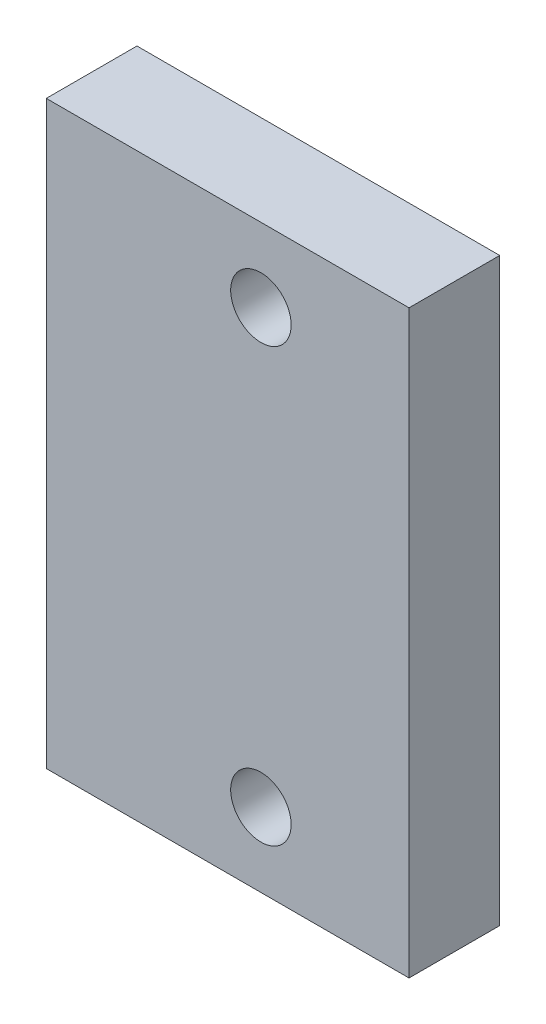
ISO-10303-21;
HEADER;
FILE_DESCRIPTION(('STEP AP214'),'2;1');
FILE_NAME('part.step','',(''),(''),'','','');
FILE_SCHEMA(('AUTOMOTIVE_DESIGN { 1 0 10303 214 1 1 1 1 }'));
ENDSEC;
DATA;
#1=APPLICATION_CONTEXT('core data for automotive mechanical design processes');
#2=APPLICATION_PROTOCOL_DEFINITION('international standard','automotive_design',2000,#1);
#3=PRODUCT_CONTEXT('',#1,'mechanical');
#4=PRODUCT('Part','Part','',(#3));
#5=PRODUCT_RELATED_PRODUCT_CATEGORY('part','',(#4));
#6=PRODUCT_DEFINITION_FORMATION('','',#4);
#7=PRODUCT_DEFINITION_CONTEXT('part definition',#1,'design');
#8=PRODUCT_DEFINITION('design','',#6,#7);
#9=PRODUCT_DEFINITION_SHAPE('','',#8);
#10=(LENGTH_UNIT() NAMED_UNIT(*) SI_UNIT(.MILLI.,.METRE.));
#11=(NAMED_UNIT(*) PLANE_ANGLE_UNIT() SI_UNIT($,.RADIAN.));
#12=(NAMED_UNIT(*) SI_UNIT($,.STERADIAN.) SOLID_ANGLE_UNIT());
#13=UNCERTAINTY_MEASURE_WITH_UNIT(LENGTH_MEASURE(1.E-05),#10,'distance_accuracy_value','');
#14=(GEOMETRIC_REPRESENTATION_CONTEXT(3) GLOBAL_UNCERTAINTY_ASSIGNED_CONTEXT((#13)) GLOBAL_UNIT_ASSIGNED_CONTEXT((#10,
#11,#12)) REPRESENTATION_CONTEXT('',''));
#15=CARTESIAN_POINT('',(0.,0.,0.));
#16=DIRECTION('',(0.,0.,1.));
#17=DIRECTION('',(1.,0.,0.));
#18=AXIS2_PLACEMENT_3D('',#15,#16,#17);
#19=CARTESIAN_POINT('',(0.,0.,15.));
#20=DIRECTION('',(0.,0.,-1.));
#21=DIRECTION('',(-1.,0.,0.));
#22=AXIS2_PLACEMENT_3D('',#19,#20,#21);
#23=PLANE('',#22);
#24=DIRECTION('',(0.,-1.,0.));
#25=VECTOR('',#24,1.);
#26=CARTESIAN_POINT('',(0.,220.509389187346,15.));
#27=LINE('',#26,#25);
#28=CARTESIAN_POINT('',(0.,316.509389187345,15.));
#29=VERTEX_POINT('',#28);
#30=CARTESIAN_POINT('',(0.,220.509389187346,15.));
#31=VERTEX_POINT('',#30);
#32=EDGE_CURVE('E84',#29,#31,#27,.T.);
#33=ORIENTED_EDGE('',*,*,#32,.T.);
#34=DIRECTION('',(1.,0.,0.));
#35=VECTOR('',#34,1.);
#36=CARTESIAN_POINT('',(0.,220.509389187346,15.));
#37=LINE('',#36,#35);
#38=CARTESIAN_POINT('',(60.,220.509389187346,15.));
#39=VERTEX_POINT('',#38);
#40=EDGE_CURVE('E79',#31,#39,#37,.T.);
#41=ORIENTED_EDGE('',*,*,#40,.T.);
#42=DIRECTION('',(0.,1.,0.));
#43=VECTOR('',#42,1.);
#44=CARTESIAN_POINT('',(60.,220.509389187346,15.));
#45=LINE('',#44,#43);
#46=CARTESIAN_POINT('',(60.,316.509389187345,15.));
#47=VERTEX_POINT('',#46);
#48=EDGE_CURVE('E82',#39,#47,#45,.T.);
#49=ORIENTED_EDGE('',*,*,#48,.T.);
#50=DIRECTION('',(-1.,0.,0.));
#51=VECTOR('',#50,1.);
#52=CARTESIAN_POINT('',(0.,316.509389187345,15.));
#53=LINE('',#52,#51);
#54=EDGE_CURVE('E49',#47,#29,#53,.T.);
#55=ORIENTED_EDGE('',*,*,#54,.T.);
#56=EDGE_LOOP('',(#33,#41,#49,#55));
#57=FACE_BOUND('',#56,.T.);
#58=CARTESIAN_POINT('',(35.4999999999999,232.728933644638,15.));
#59=DIRECTION('',(0.,0.,1.));
#60=DIRECTION('',(1.,0.,0.));
#61=AXIS2_PLACEMENT_3D('',#58,#59,#60);
#62=CIRCLE('',#61,5.);
#63=CARTESIAN_POINT('',(40.4999999999999,232.728933644638,15.));
#64=VERTEX_POINT('',#63);
#65=EDGE_CURVE('E99',#64,#64,#62,.T.);
#66=ORIENTED_EDGE('',*,*,#65,.F.);
#67=EDGE_LOOP('',(#66));
#68=FACE_BOUND('',#67,.T.);
#69=CARTESIAN_POINT('',(35.5,304.289844730052,15.));
#70=DIRECTION('',(0.,0.,1.));
#71=DIRECTION('',(1.,0.,0.));
#72=AXIS2_PLACEMENT_3D('',#69,#70,#71);
#73=CIRCLE('',#72,5.00000000000005);
#74=CARTESIAN_POINT('',(40.5,304.289844730052,15.));
#75=VERTEX_POINT('',#74);
#76=EDGE_CURVE('E114',#75,#75,#73,.T.);
#77=ORIENTED_EDGE('',*,*,#76,.F.);
#78=EDGE_LOOP('',(#77));
#79=FACE_BOUND('',#78,.T.);
#80=ADVANCED_FACE('F32',(#57,#68,#79),#23,.F.);
#81=CARTESIAN_POINT('',(0.,0.,0.));
#82=DIRECTION('',(0.,0.,-1.));
#83=DIRECTION('',(-1.,0.,0.));
#84=AXIS2_PLACEMENT_3D('',#81,#82,#83);
#85=PLANE('',#84);
#86=CARTESIAN_POINT('',(35.4999999999999,232.728933644638,0.));
#87=DIRECTION('',(0.,0.,1.));
#88=DIRECTION('',(1.,0.,0.));
#89=AXIS2_PLACEMENT_3D('',#86,#87,#88);
#90=CIRCLE('',#89,5.);
#91=CARTESIAN_POINT('',(40.4999999999999,232.728933644638,0.));
#92=VERTEX_POINT('',#91);
#93=EDGE_CURVE('E111',#92,#92,#90,.T.);
#94=ORIENTED_EDGE('',*,*,#93,.T.);
#95=EDGE_LOOP('',(#94));
#96=FACE_BOUND('',#95,.T.);
#97=DIRECTION('',(0.,-1.,0.));
#98=VECTOR('',#97,1.);
#99=CARTESIAN_POINT('',(0.,220.509389187346,0.));
#100=LINE('',#99,#98);
#101=CARTESIAN_POINT('',(0.,316.509389187345,0.));
#102=VERTEX_POINT('',#101);
#103=CARTESIAN_POINT('',(0.,220.509389187346,0.));
#104=VERTEX_POINT('',#103);
#105=EDGE_CURVE('E96',#102,#104,#100,.T.);
#106=ORIENTED_EDGE('',*,*,#105,.F.);
#107=DIRECTION('',(-1.,0.,0.));
#108=VECTOR('',#107,1.);
#109=CARTESIAN_POINT('',(0.,316.509389187345,0.));
#110=LINE('',#109,#108);
#111=CARTESIAN_POINT('',(60.,316.509389187345,0.));
#112=VERTEX_POINT('',#111);
#113=EDGE_CURVE('E72',#112,#102,#110,.T.);
#114=ORIENTED_EDGE('',*,*,#113,.F.);
#115=DIRECTION('',(0.,1.,0.));
#116=VECTOR('',#115,1.);
#117=CARTESIAN_POINT('',(60.,220.509389187346,0.));
#118=LINE('',#117,#116);
#119=CARTESIAN_POINT('',(60.,220.509389187346,0.));
#120=VERTEX_POINT('',#119);
#121=EDGE_CURVE('E66',#120,#112,#118,.T.);
#122=ORIENTED_EDGE('',*,*,#121,.F.);
#123=DIRECTION('',(1.,0.,0.));
#124=VECTOR('',#123,1.);
#125=CARTESIAN_POINT('',(0.,220.509389187346,0.));
#126=LINE('',#125,#124);
#127=EDGE_CURVE('E88',#104,#120,#126,.T.);
#128=ORIENTED_EDGE('',*,*,#127,.F.);
#129=EDGE_LOOP('',(#106,#114,#122,#128));
#130=FACE_BOUND('',#129,.T.);
#131=CARTESIAN_POINT('',(35.5,304.289844730052,0.));
#132=DIRECTION('',(0.,0.,1.));
#133=DIRECTION('',(1.,0.,0.));
#134=AXIS2_PLACEMENT_3D('',#131,#132,#133);
#135=CIRCLE('',#134,5.00000000000005);
#136=CARTESIAN_POINT('',(40.5,304.289844730052,0.));
#137=VERTEX_POINT('',#136);
#138=EDGE_CURVE('E117',#137,#137,#135,.T.);
#139=ORIENTED_EDGE('',*,*,#138,.T.);
#140=EDGE_LOOP('',(#139));
#141=FACE_BOUND('',#140,.T.);
#142=ADVANCED_FACE('F107',(#96,#130,#141),#85,.T.);
#143=CARTESIAN_POINT('',(0.,220.509389187346,15.));
#144=DIRECTION('',(1.,0.,0.));
#145=DIRECTION('',(0.,1.,0.));
#146=AXIS2_PLACEMENT_3D('',#143,#144,#145);
#147=PLANE('',#146);
#148=ORIENTED_EDGE('',*,*,#105,.T.);
#149=DIRECTION('',(0.,0.,-1.));
#150=VECTOR('',#149,1.);
#151=CARTESIAN_POINT('',(0.,220.509389187346,15.));
#152=LINE('',#151,#150);
#153=EDGE_CURVE('E11',#31,#104,#152,.T.);
#154=ORIENTED_EDGE('',*,*,#153,.F.);
#155=ORIENTED_EDGE('',*,*,#32,.F.);
#156=DIRECTION('',(0.,0.,-1.));
#157=VECTOR('',#156,1.);
#158=CARTESIAN_POINT('',(0.,316.509389187345,15.));
#159=LINE('',#158,#157);
#160=EDGE_CURVE('E92',#29,#102,#159,.T.);
#161=ORIENTED_EDGE('',*,*,#160,.T.);
#162=EDGE_LOOP('',(#148,#154,#155,#161));
#163=FACE_BOUND('',#162,.T.);
#164=ADVANCED_FACE('F34',(#163),#147,.F.);
#165=CARTESIAN_POINT('',(0.,220.509389187346,15.));
#166=DIRECTION('',(0.,1.,0.));
#167=DIRECTION('',(0.,0.,1.));
#168=AXIS2_PLACEMENT_3D('',#165,#166,#167);
#169=PLANE('',#168);
#170=ORIENTED_EDGE('',*,*,#127,.T.);
#171=DIRECTION('',(0.,0.,-1.));
#172=VECTOR('',#171,1.);
#173=CARTESIAN_POINT('',(60.,220.509389187346,15.));
#174=LINE('',#173,#172);
#175=EDGE_CURVE('E41',#39,#120,#174,.T.);
#176=ORIENTED_EDGE('',*,*,#175,.F.);
#177=ORIENTED_EDGE('',*,*,#40,.F.);
#178=ORIENTED_EDGE('',*,*,#153,.T.);
#179=EDGE_LOOP('',(#170,#176,#177,#178));
#180=FACE_BOUND('',#179,.T.);
#181=ADVANCED_FACE('F87',(#180),#169,.F.);
#182=CARTESIAN_POINT('',(60.,220.509389187346,15.));
#183=DIRECTION('',(-1.,0.,0.));
#184=DIRECTION('',(0.,0.,1.));
#185=AXIS2_PLACEMENT_3D('',#182,#183,#184);
#186=PLANE('',#185);
#187=ORIENTED_EDGE('',*,*,#121,.T.);
#188=DIRECTION('',(0.,0.,-1.));
#189=VECTOR('',#188,1.);
#190=CARTESIAN_POINT('',(60.,316.509389187345,15.));
#191=LINE('',#190,#189);
#192=EDGE_CURVE('E89',#47,#112,#191,.T.);
#193=ORIENTED_EDGE('',*,*,#192,.F.);
#194=ORIENTED_EDGE('',*,*,#48,.F.);
#195=ORIENTED_EDGE('',*,*,#175,.T.);
#196=EDGE_LOOP('',(#187,#193,#194,#195));
#197=FACE_BOUND('',#196,.T.);
#198=ADVANCED_FACE('F90',(#197),#186,.F.);
#199=CARTESIAN_POINT('',(0.,316.509389187345,15.));
#200=DIRECTION('',(0.,-1.,0.));
#201=DIRECTION('',(0.,0.,-1.));
#202=AXIS2_PLACEMENT_3D('',#199,#200,#201);
#203=PLANE('',#202);
#204=ORIENTED_EDGE('',*,*,#113,.T.);
#205=ORIENTED_EDGE('',*,*,#160,.F.);
#206=ORIENTED_EDGE('',*,*,#54,.F.);
#207=ORIENTED_EDGE('',*,*,#192,.T.);
#208=EDGE_LOOP('',(#204,#205,#206,#207));
#209=FACE_BOUND('',#208,.T.);
#210=ADVANCED_FACE('F104',(#209),#203,.F.);
#211=CARTESIAN_POINT('',(35.4999999999999,232.728933644638,15.));
#212=DIRECTION('',(0.,0.,-1.));
#213=DIRECTION('',(-1.,0.,0.));
#214=AXIS2_PLACEMENT_3D('',#211,#212,#213);
#215=CYLINDRICAL_SURFACE('',#214,5.);
#216=ORIENTED_EDGE('',*,*,#65,.T.);
#217=EDGE_LOOP('',(#216));
#218=FACE_BOUND('',#217,.T.);
#219=ORIENTED_EDGE('',*,*,#93,.F.);
#220=EDGE_LOOP('',(#219));
#221=FACE_BOUND('',#220,.T.);
#222=ADVANCED_FACE('F134',(#218,#221),#215,.F.);
#223=CARTESIAN_POINT('',(35.5,304.289844730052,15.));
#224=DIRECTION('',(0.,0.,-1.));
#225=DIRECTION('',(-1.,0.,0.));
#226=AXIS2_PLACEMENT_3D('',#223,#224,#225);
#227=CYLINDRICAL_SURFACE('',#226,5.00000000000005);
#228=ORIENTED_EDGE('',*,*,#76,.T.);
#229=EDGE_LOOP('',(#228));
#230=FACE_BOUND('',#229,.T.);
#231=ORIENTED_EDGE('',*,*,#138,.F.);
#232=EDGE_LOOP('',(#231));
#233=FACE_BOUND('',#232,.T.);
#234=ADVANCED_FACE('F123',(#230,#233),#227,.F.);
#235=CLOSED_SHELL('',(#80,#142,#164,#181,#198,#210,#222,#234));
#236=MANIFOLD_SOLID_BREP('B2',#235);
#237=ADVANCED_BREP_SHAPE_REPRESENTATION('',(#18,#236),#14);
#238=SHAPE_DEFINITION_REPRESENTATION(#9,#237);
ENDSEC;
END-ISO-10303-21;
